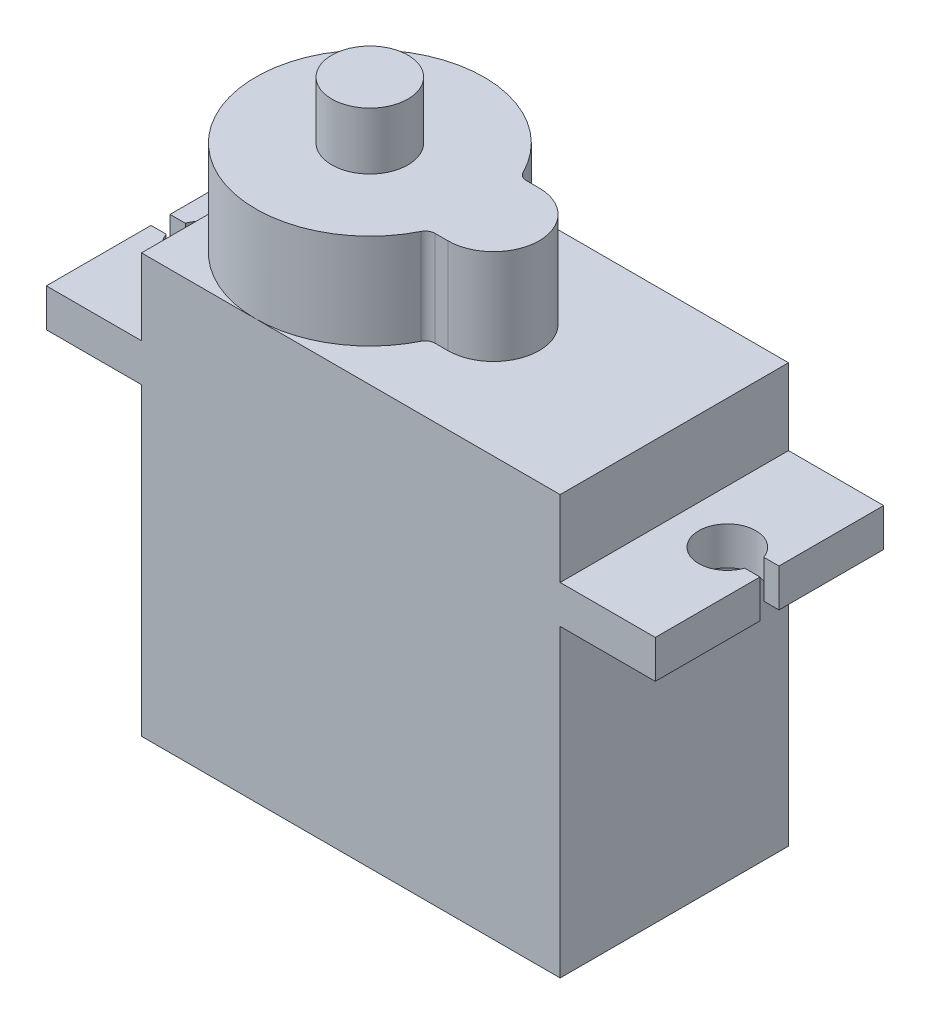
ISO-10303-21;
HEADER;
FILE_DESCRIPTION(('STEP AP214'),'2;1');
FILE_NAME('part.step','',(''),(''),'','','');
FILE_SCHEMA(('AUTOMOTIVE_DESIGN { 1 0 10303 214 1 1 1 1 }'));
ENDSEC;
DATA;
#1=APPLICATION_CONTEXT('core data for automotive mechanical design processes');
#2=APPLICATION_PROTOCOL_DEFINITION('international standard','automotive_design',2000,#1);
#3=PRODUCT_CONTEXT('',#1,'mechanical');
#4=PRODUCT('Part','Part','',(#3));
#5=PRODUCT_RELATED_PRODUCT_CATEGORY('part','',(#4));
#6=PRODUCT_DEFINITION_FORMATION('','',#4);
#7=PRODUCT_DEFINITION_CONTEXT('part definition',#1,'design');
#8=PRODUCT_DEFINITION('design','',#6,#7);
#9=PRODUCT_DEFINITION_SHAPE('','',#8);
#10=(LENGTH_UNIT() NAMED_UNIT(*) SI_UNIT(.MILLI.,.METRE.));
#11=(NAMED_UNIT(*) PLANE_ANGLE_UNIT() SI_UNIT($,.RADIAN.));
#12=(NAMED_UNIT(*) SI_UNIT($,.STERADIAN.) SOLID_ANGLE_UNIT());
#13=UNCERTAINTY_MEASURE_WITH_UNIT(LENGTH_MEASURE(1.E-05),#10,'distance_accuracy_value','');
#14=(GEOMETRIC_REPRESENTATION_CONTEXT(3) GLOBAL_UNCERTAINTY_ASSIGNED_CONTEXT((#13)) GLOBAL_UNIT_ASSIGNED_CONTEXT((#10,
#11,#12)) REPRESENTATION_CONTEXT('',''));
#15=CARTESIAN_POINT('',(0.,0.,0.));
#16=DIRECTION('',(0.,0.,1.));
#17=DIRECTION('',(1.,0.,0.));
#18=AXIS2_PLACEMENT_3D('',#15,#16,#17);
#19=CARTESIAN_POINT('',(-16.,7.,-12.));
#20=DIRECTION('',(-1.,0.,0.));
#21=DIRECTION('',(0.,0.,1.));
#22=AXIS2_PLACEMENT_3D('',#19,#20,#21);
#23=PLANE('',#22);
#24=DIRECTION('',(0.,0.,1.));
#25=VECTOR('',#24,1.);
#26=CARTESIAN_POINT('',(-16.,7.,-12.));
#27=LINE('',#26,#25);
#28=CARTESIAN_POINT('',(-16.,7.,-5.49999999997551));
#29=VERTEX_POINT('',#28);
#30=CARTESIAN_POINT('',(-16.,7.,0.));
#31=VERTEX_POINT('',#30);
#32=EDGE_CURVE('E455',#29,#31,#27,.T.);
#33=ORIENTED_EDGE('',*,*,#32,.F.);
#34=DIRECTION('',(0.,1.,0.));
#35=VECTOR('',#34,1.);
#36=CARTESIAN_POINT('',(-16.,-11.,-5.49999999997551));
#37=LINE('',#36,#35);
#38=CARTESIAN_POINT('',(-16.,4.99999999999999,-5.49999999997551));
#39=VERTEX_POINT('',#38);
#40=EDGE_CURVE('E255',#39,#29,#37,.T.);
#41=ORIENTED_EDGE('',*,*,#40,.F.);
#42=DIRECTION('',(0.,0.,1.));
#43=VECTOR('',#42,1.);
#44=CARTESIAN_POINT('',(-16.,5.,-12.));
#45=LINE('',#44,#43);
#46=CARTESIAN_POINT('',(-16.,5.,0.));
#47=VERTEX_POINT('',#46);
#48=EDGE_CURVE('E450',#39,#47,#45,.T.);
#49=ORIENTED_EDGE('',*,*,#48,.T.);
#50=DIRECTION('',(0.,-1.,0.));
#51=VECTOR('',#50,1.);
#52=CARTESIAN_POINT('',(-16.,7.,0.));
#53=LINE('',#52,#51);
#54=EDGE_CURVE('E391',#31,#47,#53,.T.);
#55=ORIENTED_EDGE('',*,*,#54,.F.);
#56=EDGE_LOOP('',(#33,#41,#49,#55));
#57=FACE_BOUND('',#56,.T.);
#58=ADVANCED_FACE('F46',(#57),#23,.T.);
#59=CARTESIAN_POINT('',(-16.,5.,-12.));
#60=VERTEX_POINT('',#59);
#61=CARTESIAN_POINT('',(-16.,4.99999999999999,-6.49999999997551));
#62=VERTEX_POINT('',#61);
#63=EDGE_CURVE('E447',#60,#62,#45,.T.);
#64=ORIENTED_EDGE('',*,*,#63,.T.);
#65=DIRECTION('',(0.,1.,0.));
#66=VECTOR('',#65,1.);
#67=CARTESIAN_POINT('',(-16.,-11.,-6.49999999997551));
#68=LINE('',#67,#66);
#69=CARTESIAN_POINT('',(-16.,7.,-6.49999999997551));
#70=VERTEX_POINT('',#69);
#71=EDGE_CURVE('E235',#62,#70,#68,.T.);
#72=ORIENTED_EDGE('',*,*,#71,.T.);
#73=CARTESIAN_POINT('',(-16.,7.,-12.));
#74=VERTEX_POINT('',#73);
#75=EDGE_CURVE('E451',#74,#70,#27,.T.);
#76=ORIENTED_EDGE('',*,*,#75,.F.);
#77=DIRECTION('',(0.,-1.,0.));
#78=VECTOR('',#77,1.);
#79=CARTESIAN_POINT('',(-16.,7.,-12.));
#80=LINE('',#79,#78);
#81=EDGE_CURVE('E342',#74,#60,#80,.T.);
#82=ORIENTED_EDGE('',*,*,#81,.T.);
#83=EDGE_LOOP('',(#64,#72,#76,#82));
#84=FACE_BOUND('',#83,.T.);
#85=ADVANCED_FACE('F535',(#84),#23,.T.);
#86=CARTESIAN_POINT('',(16.,7.,-12.));
#87=DIRECTION('',(1.,0.,0.));
#88=DIRECTION('',(0.,0.,-1.));
#89=AXIS2_PLACEMENT_3D('',#86,#87,#88);
#90=PLANE('',#89);
#91=DIRECTION('',(0.,1.,0.));
#92=VECTOR('',#91,1.);
#93=CARTESIAN_POINT('',(16.,-11.,-5.49999999997551));
#94=LINE('',#93,#92);
#95=CARTESIAN_POINT('',(16.,5.,-5.49999999997551));
#96=VERTEX_POINT('',#95);
#97=CARTESIAN_POINT('',(16.,7.,-5.49999999997551));
#98=VERTEX_POINT('',#97);
#99=EDGE_CURVE('E263',#96,#98,#94,.T.);
#100=ORIENTED_EDGE('',*,*,#99,.T.);
#101=DIRECTION('',(0.,0.,1.));
#102=VECTOR('',#101,1.);
#103=CARTESIAN_POINT('',(16.,7.,-12.));
#104=LINE('',#103,#102);
#105=CARTESIAN_POINT('',(16.,7.,0.));
#106=VERTEX_POINT('',#105);
#107=EDGE_CURVE('E429',#98,#106,#104,.T.);
#108=ORIENTED_EDGE('',*,*,#107,.T.);
#109=DIRECTION('',(0.,1.,0.));
#110=VECTOR('',#109,1.);
#111=CARTESIAN_POINT('',(16.,7.,0.));
#112=LINE('',#111,#110);
#113=CARTESIAN_POINT('',(16.,5.,0.));
#114=VERTEX_POINT('',#113);
#115=EDGE_CURVE('E415',#114,#106,#112,.T.);
#116=ORIENTED_EDGE('',*,*,#115,.F.);
#117=DIRECTION('',(0.,0.,1.));
#118=VECTOR('',#117,1.);
#119=CARTESIAN_POINT('',(16.,5.,-12.));
#120=LINE('',#119,#118);
#121=EDGE_CURVE('E434',#96,#114,#120,.T.);
#122=ORIENTED_EDGE('',*,*,#121,.F.);
#123=EDGE_LOOP('',(#100,#108,#116,#122));
#124=FACE_BOUND('',#123,.T.);
#125=ADVANCED_FACE('F541',(#124),#90,.T.);
#126=CARTESIAN_POINT('',(-11.,11.,-12.));
#127=DIRECTION('',(0.,1.,0.));
#128=DIRECTION('',(0.,0.,1.));
#129=AXIS2_PLACEMENT_3D('',#126,#127,#128);
#130=PLANE('',#129);
#131=CARTESIAN_POINT('',(-5.,11.,-6.));
#132=DIRECTION('',(0.,1.,0.));
#133=DIRECTION('',(0.,0.,1.));
#134=AXIS2_PLACEMENT_3D('',#131,#132,#133);
#135=CIRCLE('',#134,6.);
#136=CARTESIAN_POINT('',(-11.,11.,-6.));
#137=VERTEX_POINT('',#136);
#138=CARTESIAN_POINT('',(-5.,11.,0.));
#139=VERTEX_POINT('',#138);
#140=EDGE_CURVE('E312',#137,#139,#135,.T.);
#141=ORIENTED_EDGE('',*,*,#140,.F.);
#142=DIRECTION('',(0.,0.,1.));
#143=VECTOR('',#142,1.);
#144=CARTESIAN_POINT('',(-11.,11.,-12.));
#145=LINE('',#144,#143);
#146=CARTESIAN_POINT('',(-11.,11.,0.));
#147=VERTEX_POINT('',#146);
#148=EDGE_CURVE('E463',#137,#147,#145,.T.);
#149=ORIENTED_EDGE('',*,*,#148,.T.);
#150=DIRECTION('',(-1.,0.,0.));
#151=VECTOR('',#150,1.);
#152=CARTESIAN_POINT('',(-11.,11.,0.));
#153=LINE('',#152,#151);
#154=EDGE_CURVE('E378',#139,#147,#153,.T.);
#155=ORIENTED_EDGE('',*,*,#154,.F.);
#156=EDGE_LOOP('',(#141,#149,#155));
#157=FACE_BOUND('',#156,.T.);
#158=ADVANCED_FACE('F560',(#157),#130,.T.);
#159=CARTESIAN_POINT('',(0.369737688215013,11.,-8.67692307692308));
#160=VERTEX_POINT('',#159);
#161=CARTESIAN_POINT('',(-5.,11.,-12.));
#162=VERTEX_POINT('',#161);
#163=EDGE_CURVE('E309',#160,#162,#135,.T.);
#164=ORIENTED_EDGE('',*,*,#163,.F.);
#165=CARTESIAN_POINT('',(0.817215828899599,11.,-8.9));
#166=DIRECTION('',(0.,1.,0.));
#167=DIRECTION('',(0.,0.,1.));
#168=AXIS2_PLACEMENT_3D('',#165,#166,#167);
#169=CIRCLE('',#168,0.5);
#170=CARTESIAN_POINT('',(0.817215828899597,11.,-8.4));
#171=VERTEX_POINT('',#170);
#172=EDGE_CURVE('E495',#160,#171,#169,.T.);
#173=ORIENTED_EDGE('',*,*,#172,.T.);
#174=DIRECTION('',(-1.,0.,0.));
#175=VECTOR('',#174,1.);
#176=CARTESIAN_POINT('',(1.49909083394701,11.,-8.4));
#177=LINE('',#176,#175);
#178=CARTESIAN_POINT('',(1.49909083394701,11.,-8.4));
#179=VERTEX_POINT('',#178);
#180=EDGE_CURVE('E306',#179,#171,#177,.T.);
#181=ORIENTED_EDGE('',*,*,#180,.F.);
#182=CARTESIAN_POINT('',(1.49909083394701,11.,-6.));
#183=DIRECTION('',(0.,1.,0.));
#184=DIRECTION('',(0.,0.,1.));
#185=AXIS2_PLACEMENT_3D('',#182,#183,#184);
#186=CIRCLE('',#185,2.4);
#187=CARTESIAN_POINT('',(1.49909083394701,11.,-3.6));
#188=VERTEX_POINT('',#187);
#189=EDGE_CURVE('E287',#188,#179,#186,.T.);
#190=ORIENTED_EDGE('',*,*,#189,.F.);
#191=DIRECTION('',(1.,0.,0.));
#192=VECTOR('',#191,1.);
#193=CARTESIAN_POINT('',(1.49909083394701,11.,-3.6));
#194=LINE('',#193,#192);
#195=CARTESIAN_POINT('',(0.817215828899599,11.,-3.6));
#196=VERTEX_POINT('',#195);
#197=EDGE_CURVE('E293',#196,#188,#194,.T.);
#198=ORIENTED_EDGE('',*,*,#197,.F.);
#199=CARTESIAN_POINT('',(0.817215828899599,11.,-3.1));
#200=DIRECTION('',(0.,1.,0.));
#201=DIRECTION('',(0.,0.,1.));
#202=AXIS2_PLACEMENT_3D('',#199,#200,#201);
#203=CIRCLE('',#202,0.5);
#204=CARTESIAN_POINT('',(0.369737688215014,11.,-3.32307692307692));
#205=VERTEX_POINT('',#204);
#206=EDGE_CURVE('E492',#196,#205,#203,.T.);
#207=ORIENTED_EDGE('',*,*,#206,.T.);
#208=EDGE_CURVE('E589',#139,#205,#135,.T.);
#209=ORIENTED_EDGE('',*,*,#208,.F.);
#210=CARTESIAN_POINT('',(11.,11.,0.));
#211=VERTEX_POINT('',#210);
#212=EDGE_CURVE('E379',#211,#139,#153,.T.);
#213=ORIENTED_EDGE('',*,*,#212,.F.);
#214=DIRECTION('',(0.,0.,1.));
#215=VECTOR('',#214,1.);
#216=CARTESIAN_POINT('',(11.,11.,-12.));
#217=LINE('',#216,#215);
#218=CARTESIAN_POINT('',(11.,11.,-12.));
#219=VERTEX_POINT('',#218);
#220=EDGE_CURVE('E374',#219,#211,#217,.T.);
#221=ORIENTED_EDGE('',*,*,#220,.F.);
#222=DIRECTION('',(-1.,0.,0.));
#223=VECTOR('',#222,1.);
#224=CARTESIAN_POINT('',(-11.,11.,-12.));
#225=LINE('',#224,#223);
#226=EDGE_CURVE('E330',#219,#162,#225,.T.);
#227=ORIENTED_EDGE('',*,*,#226,.T.);
#228=EDGE_LOOP('',(#164,#173,#181,#190,#198,#207,#209,#213,#221,#227));
#229=FACE_BOUND('',#228,.T.);
#230=ADVANCED_FACE('F516',(#229),#130,.T.);
#231=CARTESIAN_POINT('',(11.,7.,-12.));
#232=DIRECTION('',(1.,0.,0.));
#233=DIRECTION('',(0.,0.,-1.));
#234=AXIS2_PLACEMENT_3D('',#231,#232,#233);
#235=PLANE('',#234);
#236=DIRECTION('',(0.,1.,0.));
#237=VECTOR('',#236,1.);
#238=CARTESIAN_POINT('',(11.,7.,0.));
#239=LINE('',#238,#237);
#240=CARTESIAN_POINT('',(11.,7.,0.));
#241=VERTEX_POINT('',#240);
#242=EDGE_CURVE('E323',#241,#211,#239,.T.);
#243=ORIENTED_EDGE('',*,*,#242,.F.);
#244=DIRECTION('',(0.,0.,1.));
#245=VECTOR('',#244,1.);
#246=CARTESIAN_POINT('',(11.,7.,-12.));
#247=LINE('',#246,#245);
#248=CARTESIAN_POINT('',(11.,7.,-12.));
#249=VERTEX_POINT('',#248);
#250=EDGE_CURVE('E422',#249,#241,#247,.T.);
#251=ORIENTED_EDGE('',*,*,#250,.F.);
#252=DIRECTION('',(0.,1.,0.));
#253=VECTOR('',#252,1.);
#254=CARTESIAN_POINT('',(11.,7.,-12.));
#255=LINE('',#254,#253);
#256=EDGE_CURVE('E324',#249,#219,#255,.T.);
#257=ORIENTED_EDGE('',*,*,#256,.T.);
#258=ORIENTED_EDGE('',*,*,#220,.T.);
#259=EDGE_LOOP('',(#243,#251,#257,#258));
#260=FACE_BOUND('',#259,.T.);
#261=ADVANCED_FACE('F561',(#260),#235,.T.);
#262=CARTESIAN_POINT('',(11.,7.,-12.));
#263=DIRECTION('',(0.,1.,0.));
#264=DIRECTION('',(0.,0.,1.));
#265=AXIS2_PLACEMENT_3D('',#262,#263,#264);
#266=PLANE('',#265);
#267=DIRECTION('',(1.,0.,0.));
#268=VECTOR('',#267,1.);
#269=CARTESIAN_POINT('',(11.,7.,-5.4999999999755));
#270=LINE('',#269,#268);
#271=CARTESIAN_POINT('',(15.2,7.,-5.49999999997551));
#272=VERTEX_POINT('',#271);
#273=EDGE_CURVE('E284',#272,#98,#270,.T.);
#274=ORIENTED_EDGE('',*,*,#273,.F.);
#275=CARTESIAN_POINT('',(13.7857864376269,7.,-5.99999999997551));
#276=DIRECTION('',(0.,1.,0.));
#277=DIRECTION('',(0.,0.,1.));
#278=AXIS2_PLACEMENT_3D('',#275,#276,#277);
#279=CIRCLE('',#278,1.5);
#280=CARTESIAN_POINT('',(15.2,7.,-6.49999999997551));
#281=VERTEX_POINT('',#280);
#282=EDGE_CURVE('E281',#281,#272,#279,.T.);
#283=ORIENTED_EDGE('',*,*,#282,.F.);
#284=DIRECTION('',(-1.,0.,0.));
#285=VECTOR('',#284,1.);
#286=CARTESIAN_POINT('',(11.,7.,-6.49999999997551));
#287=LINE('',#286,#285);
#288=CARTESIAN_POINT('',(16.,7.,-6.49999999997551));
#289=VERTEX_POINT('',#288);
#290=EDGE_CURVE('E268',#289,#281,#287,.T.);
#291=ORIENTED_EDGE('',*,*,#290,.F.);
#292=CARTESIAN_POINT('',(16.,7.,-12.));
#293=VERTEX_POINT('',#292);
#294=EDGE_CURVE('E425',#293,#289,#104,.T.);
#295=ORIENTED_EDGE('',*,*,#294,.F.);
#296=DIRECTION('',(-1.,0.,0.));
#297=VECTOR('',#296,1.);
#298=CARTESIAN_POINT('',(11.,7.,-12.));
#299=LINE('',#298,#297);
#300=EDGE_CURVE('E370',#293,#249,#299,.T.);
#301=ORIENTED_EDGE('',*,*,#300,.T.);
#302=ORIENTED_EDGE('',*,*,#250,.T.);
#303=DIRECTION('',(-1.,0.,0.));
#304=VECTOR('',#303,1.);
#305=CARTESIAN_POINT('',(11.,7.,0.));
#306=LINE('',#305,#304);
#307=EDGE_CURVE('E329',#106,#241,#306,.T.);
#308=ORIENTED_EDGE('',*,*,#307,.F.);
#309=ORIENTED_EDGE('',*,*,#107,.F.);
#310=EDGE_LOOP('',(#274,#283,#291,#295,#301,#302,#308,#309));
#311=FACE_BOUND('',#310,.T.);
#312=ADVANCED_FACE('F563',(#311),#266,.T.);
#313=DIRECTION('',(0.,1.,0.));
#314=VECTOR('',#313,1.);
#315=CARTESIAN_POINT('',(16.,-11.,-6.49999999997551));
#316=LINE('',#315,#314);
#317=CARTESIAN_POINT('',(16.,5.,-6.49999999997551));
#318=VERTEX_POINT('',#317);
#319=EDGE_CURVE('E273',#318,#289,#316,.T.);
#320=ORIENTED_EDGE('',*,*,#319,.F.);
#321=CARTESIAN_POINT('',(16.,5.,-12.));
#322=VERTEX_POINT('',#321);
#323=EDGE_CURVE('E430',#322,#318,#120,.T.);
#324=ORIENTED_EDGE('',*,*,#323,.F.);
#325=DIRECTION('',(0.,1.,0.));
#326=VECTOR('',#325,1.);
#327=CARTESIAN_POINT('',(16.,7.,-12.));
#328=LINE('',#327,#326);
#329=EDGE_CURVE('E366',#322,#293,#328,.T.);
#330=ORIENTED_EDGE('',*,*,#329,.T.);
#331=ORIENTED_EDGE('',*,*,#294,.T.);
#332=EDGE_LOOP('',(#320,#324,#330,#331));
#333=FACE_BOUND('',#332,.T.);
#334=ADVANCED_FACE('F569',(#333),#90,.T.);
#335=CARTESIAN_POINT('',(16.,5.,-12.));
#336=DIRECTION('',(0.,-1.,0.));
#337=DIRECTION('',(1.,0.,0.));
#338=AXIS2_PLACEMENT_3D('',#335,#336,#337);
#339=PLANE('',#338);
#340=DIRECTION('',(-1.,0.,0.));
#341=VECTOR('',#340,1.);
#342=CARTESIAN_POINT('',(16.,5.,-5.49999999997551));
#343=LINE('',#342,#341);
#344=CARTESIAN_POINT('',(15.2,5.,-5.49999999997551));
#345=VERTEX_POINT('',#344);
#346=EDGE_CURVE('E473',#96,#345,#343,.T.);
#347=ORIENTED_EDGE('',*,*,#346,.F.);
#348=ORIENTED_EDGE('',*,*,#121,.T.);
#349=DIRECTION('',(1.,0.,0.));
#350=VECTOR('',#349,1.);
#351=CARTESIAN_POINT('',(16.,5.,0.));
#352=LINE('',#351,#350);
#353=CARTESIAN_POINT('',(11.,5.,0.));
#354=VERTEX_POINT('',#353);
#355=EDGE_CURVE('E411',#354,#114,#352,.T.);
#356=ORIENTED_EDGE('',*,*,#355,.F.);
#357=DIRECTION('',(0.,0.,1.));
#358=VECTOR('',#357,1.);
#359=CARTESIAN_POINT('',(11.,5.,-12.));
#360=LINE('',#359,#358);
#361=CARTESIAN_POINT('',(11.,5.,-12.));
#362=VERTEX_POINT('',#361);
#363=EDGE_CURVE('E435',#362,#354,#360,.T.);
#364=ORIENTED_EDGE('',*,*,#363,.F.);
#365=DIRECTION('',(1.,0.,0.));
#366=VECTOR('',#365,1.);
#367=CARTESIAN_POINT('',(16.,5.,-12.));
#368=LINE('',#367,#366);
#369=EDGE_CURVE('E362',#362,#322,#368,.T.);
#370=ORIENTED_EDGE('',*,*,#369,.T.);
#371=ORIENTED_EDGE('',*,*,#323,.T.);
#372=DIRECTION('',(1.,0.,0.));
#373=VECTOR('',#372,1.);
#374=CARTESIAN_POINT('',(16.,5.,-6.49999999997551));
#375=LINE('',#374,#373);
#376=CARTESIAN_POINT('',(15.2,5.,-6.49999999997551));
#377=VERTEX_POINT('',#376);
#378=EDGE_CURVE('E466',#377,#318,#375,.T.);
#379=ORIENTED_EDGE('',*,*,#378,.F.);
#380=CARTESIAN_POINT('',(13.7857864376269,5.,-5.99999999997551));
#381=DIRECTION('',(0.,-1.,0.));
#382=DIRECTION('',(1.,0.,0.));
#383=AXIS2_PLACEMENT_3D('',#380,#381,#382);
#384=CIRCLE('',#383,1.5);
#385=EDGE_CURVE('E469',#345,#377,#384,.T.);
#386=ORIENTED_EDGE('',*,*,#385,.F.);
#387=EDGE_LOOP('',(#347,#348,#356,#364,#370,#371,#379,#386));
#388=FACE_BOUND('',#387,.T.);
#389=ADVANCED_FACE('F631',(#388),#339,.T.);
#390=CARTESIAN_POINT('',(11.,-11.,-12.));
#391=DIRECTION('',(1.,0.,0.));
#392=DIRECTION('',(0.,0.,-1.));
#393=AXIS2_PLACEMENT_3D('',#390,#391,#392);
#394=PLANE('',#393);
#395=DIRECTION('',(0.,1.,0.));
#396=VECTOR('',#395,1.);
#397=CARTESIAN_POINT('',(11.,-11.,0.));
#398=LINE('',#397,#396);
#399=CARTESIAN_POINT('',(11.,-11.,0.));
#400=VERTEX_POINT('',#399);
#401=EDGE_CURVE('E407',#400,#354,#398,.T.);
#402=ORIENTED_EDGE('',*,*,#401,.F.);
#403=DIRECTION('',(0.,0.,1.));
#404=VECTOR('',#403,1.);
#405=CARTESIAN_POINT('',(11.,-11.,-12.));
#406=LINE('',#405,#404);
#407=CARTESIAN_POINT('',(11.,-11.,-12.));
#408=VERTEX_POINT('',#407);
#409=EDGE_CURVE('E438',#408,#400,#406,.T.);
#410=ORIENTED_EDGE('',*,*,#409,.F.);
#411=DIRECTION('',(0.,1.,0.));
#412=VECTOR('',#411,1.);
#413=CARTESIAN_POINT('',(11.,-11.,-12.));
#414=LINE('',#413,#412);
#415=EDGE_CURVE('E358',#408,#362,#414,.T.);
#416=ORIENTED_EDGE('',*,*,#415,.T.);
#417=ORIENTED_EDGE('',*,*,#363,.T.);
#418=EDGE_LOOP('',(#402,#410,#416,#417));
#419=FACE_BOUND('',#418,.T.);
#420=ADVANCED_FACE('F627',(#419),#394,.T.);
#421=CARTESIAN_POINT('',(-11.,-11.,-12.));
#422=DIRECTION('',(0.,-1.,0.));
#423=DIRECTION('',(0.,0.,-1.));
#424=AXIS2_PLACEMENT_3D('',#421,#422,#423);
#425=PLANE('',#424);
#426=DIRECTION('',(1.,0.,0.));
#427=VECTOR('',#426,1.);
#428=CARTESIAN_POINT('',(-11.,-11.,0.));
#429=LINE('',#428,#427);
#430=CARTESIAN_POINT('',(-11.,-11.,0.));
#431=VERTEX_POINT('',#430);
#432=EDGE_CURVE('E403',#431,#400,#429,.T.);
#433=ORIENTED_EDGE('',*,*,#432,.F.);
#434=DIRECTION('',(0.,0.,1.));
#435=VECTOR('',#434,1.);
#436=CARTESIAN_POINT('',(-11.,-11.,-12.));
#437=LINE('',#436,#435);
#438=CARTESIAN_POINT('',(-11.,-11.,-12.));
#439=VERTEX_POINT('',#438);
#440=EDGE_CURVE('E441',#439,#431,#437,.T.);
#441=ORIENTED_EDGE('',*,*,#440,.F.);
#442=DIRECTION('',(1.,0.,0.));
#443=VECTOR('',#442,1.);
#444=CARTESIAN_POINT('',(-11.,-11.,-12.));
#445=LINE('',#444,#443);
#446=EDGE_CURVE('E354',#439,#408,#445,.T.);
#447=ORIENTED_EDGE('',*,*,#446,.T.);
#448=ORIENTED_EDGE('',*,*,#409,.T.);
#449=EDGE_LOOP('',(#433,#441,#447,#448));
#450=FACE_BOUND('',#449,.T.);
#451=ADVANCED_FACE('F623',(#450),#425,.T.);
#452=CARTESIAN_POINT('',(-11.,-11.,-12.));
#453=DIRECTION('',(-1.,0.,0.));
#454=DIRECTION('',(0.,0.,1.));
#455=AXIS2_PLACEMENT_3D('',#452,#453,#454);
#456=PLANE('',#455);
#457=DIRECTION('',(0.,-1.,0.));
#458=VECTOR('',#457,1.);
#459=CARTESIAN_POINT('',(-11.,-11.,0.));
#460=LINE('',#459,#458);
#461=CARTESIAN_POINT('',(-11.,5.,0.));
#462=VERTEX_POINT('',#461);
#463=EDGE_CURVE('E399',#462,#431,#460,.T.);
#464=ORIENTED_EDGE('',*,*,#463,.F.);
#465=DIRECTION('',(0.,0.,1.));
#466=VECTOR('',#465,1.);
#467=CARTESIAN_POINT('',(-11.,5.,-12.));
#468=LINE('',#467,#466);
#469=CARTESIAN_POINT('',(-11.,5.,-12.));
#470=VERTEX_POINT('',#469);
#471=EDGE_CURVE('E444',#470,#462,#468,.T.);
#472=ORIENTED_EDGE('',*,*,#471,.F.);
#473=DIRECTION('',(0.,-1.,0.));
#474=VECTOR('',#473,1.);
#475=CARTESIAN_POINT('',(-11.,-11.,-12.));
#476=LINE('',#475,#474);
#477=EDGE_CURVE('E350',#470,#439,#476,.T.);
#478=ORIENTED_EDGE('',*,*,#477,.T.);
#479=ORIENTED_EDGE('',*,*,#440,.T.);
#480=EDGE_LOOP('',(#464,#472,#478,#479));
#481=FACE_BOUND('',#480,.T.);
#482=ADVANCED_FACE('F619',(#481),#456,.T.);
#483=CARTESIAN_POINT('',(-16.,5.,-12.));
#484=DIRECTION('',(0.,-1.,0.));
#485=DIRECTION('',(0.,0.,-1.));
#486=AXIS2_PLACEMENT_3D('',#483,#484,#485);
#487=PLANE('',#486);
#488=ORIENTED_EDGE('',*,*,#48,.F.);
#489=DIRECTION('',(1.,0.,0.));
#490=VECTOR('',#489,1.);
#491=CARTESIAN_POINT('',(-16.,5.,-5.49999999997551));
#492=LINE('',#491,#490);
#493=CARTESIAN_POINT('',(-15.2,4.99999999999999,-5.49999999997551));
#494=VERTEX_POINT('',#493);
#495=EDGE_CURVE('E240',#39,#494,#492,.T.);
#496=ORIENTED_EDGE('',*,*,#495,.T.);
#497=CARTESIAN_POINT('',(-13.7857864376269,4.99999999999999,-5.99999999997551));
#498=DIRECTION('',(0.,-1.,0.));
#499=DIRECTION('',(0.,0.,-1.));
#500=AXIS2_PLACEMENT_3D('',#497,#498,#499);
#501=CIRCLE('',#500,1.5);
#502=CARTESIAN_POINT('',(-15.2,4.99999999999999,-6.49999999997551));
#503=VERTEX_POINT('',#502);
#504=EDGE_CURVE('E241',#494,#503,#501,.F.);
#505=ORIENTED_EDGE('',*,*,#504,.T.);
#506=DIRECTION('',(-1.,0.,0.));
#507=VECTOR('',#506,1.);
#508=CARTESIAN_POINT('',(-16.,5.,-6.49999999997551));
#509=LINE('',#508,#507);
#510=EDGE_CURVE('E229',#503,#62,#509,.T.);
#511=ORIENTED_EDGE('',*,*,#510,.T.);
#512=ORIENTED_EDGE('',*,*,#63,.F.);
#513=DIRECTION('',(1.,0.,0.));
#514=VECTOR('',#513,1.);
#515=CARTESIAN_POINT('',(-16.,5.,-12.));
#516=LINE('',#515,#514);
#517=EDGE_CURVE('E346',#60,#470,#516,.T.);
#518=ORIENTED_EDGE('',*,*,#517,.T.);
#519=ORIENTED_EDGE('',*,*,#471,.T.);
#520=DIRECTION('',(1.,0.,0.));
#521=VECTOR('',#520,1.);
#522=CARTESIAN_POINT('',(-16.,5.,0.));
#523=LINE('',#522,#521);
#524=EDGE_CURVE('E395',#47,#462,#523,.T.);
#525=ORIENTED_EDGE('',*,*,#524,.F.);
#526=EDGE_LOOP('',(#488,#496,#505,#511,#512,#518,#519,#525));
#527=FACE_BOUND('',#526,.T.);
#528=ADVANCED_FACE('F253',(#527),#487,.T.);
#529=CARTESIAN_POINT('',(-11.,7.,-12.));
#530=DIRECTION('',(0.,1.,0.));
#531=DIRECTION('',(-1.,0.,0.));
#532=AXIS2_PLACEMENT_3D('',#529,#530,#531);
#533=PLANE('',#532);
#534=CARTESIAN_POINT('',(-13.7857864376269,7.,-5.99999999997551));
#535=DIRECTION('',(0.,1.,0.));
#536=DIRECTION('',(-1.,0.,0.));
#537=AXIS2_PLACEMENT_3D('',#534,#535,#536);
#538=CIRCLE('',#537,1.5);
#539=CARTESIAN_POINT('',(-15.2,7.,-6.49999999997551));
#540=VERTEX_POINT('',#539);
#541=CARTESIAN_POINT('',(-15.2,7.,-5.49999999997551));
#542=VERTEX_POINT('',#541);
#543=EDGE_CURVE('E247',#540,#542,#538,.F.);
#544=ORIENTED_EDGE('',*,*,#543,.T.);
#545=DIRECTION('',(-1.,0.,0.));
#546=VECTOR('',#545,1.);
#547=CARTESIAN_POINT('',(-11.,7.,-5.4999999999755));
#548=LINE('',#547,#546);
#549=EDGE_CURVE('E481',#542,#29,#548,.T.);
#550=ORIENTED_EDGE('',*,*,#549,.T.);
#551=ORIENTED_EDGE('',*,*,#32,.T.);
#552=DIRECTION('',(-1.,0.,0.));
#553=VECTOR('',#552,1.);
#554=CARTESIAN_POINT('',(-11.,7.,0.));
#555=LINE('',#554,#553);
#556=CARTESIAN_POINT('',(-11.,7.,0.));
#557=VERTEX_POINT('',#556);
#558=EDGE_CURVE('E387',#557,#31,#555,.T.);
#559=ORIENTED_EDGE('',*,*,#558,.F.);
#560=DIRECTION('',(0.,0.,1.));
#561=VECTOR('',#560,1.);
#562=CARTESIAN_POINT('',(-11.,7.,-12.));
#563=LINE('',#562,#561);
#564=CARTESIAN_POINT('',(-11.,7.,-12.));
#565=VERTEX_POINT('',#564);
#566=EDGE_CURVE('E456',#565,#557,#563,.T.);
#567=ORIENTED_EDGE('',*,*,#566,.F.);
#568=DIRECTION('',(-1.,0.,0.));
#569=VECTOR('',#568,1.);
#570=CARTESIAN_POINT('',(-11.,7.,-12.));
#571=LINE('',#570,#569);
#572=EDGE_CURVE('E338',#565,#74,#571,.T.);
#573=ORIENTED_EDGE('',*,*,#572,.T.);
#574=ORIENTED_EDGE('',*,*,#75,.T.);
#575=DIRECTION('',(1.,0.,0.));
#576=VECTOR('',#575,1.);
#577=CARTESIAN_POINT('',(-11.,7.,-6.49999999997551));
#578=LINE('',#577,#576);
#579=EDGE_CURVE('E478',#70,#540,#578,.T.);
#580=ORIENTED_EDGE('',*,*,#579,.T.);
#581=EDGE_LOOP('',(#544,#550,#551,#559,#567,#573,#574,#580));
#582=FACE_BOUND('',#581,.T.);
#583=ADVANCED_FACE('F547',(#582),#533,.T.);
#584=CARTESIAN_POINT('',(-11.,7.,-12.));
#585=DIRECTION('',(-1.,0.,0.));
#586=DIRECTION('',(0.,0.,1.));
#587=AXIS2_PLACEMENT_3D('',#584,#585,#586);
#588=PLANE('',#587);
#589=DIRECTION('',(0.,-1.,0.));
#590=VECTOR('',#589,1.);
#591=CARTESIAN_POINT('',(-11.,7.,0.));
#592=LINE('',#591,#590);
#593=EDGE_CURVE('E383',#147,#557,#592,.T.);
#594=ORIENTED_EDGE('',*,*,#593,.F.);
#595=ORIENTED_EDGE('',*,*,#148,.F.);
#596=CARTESIAN_POINT('',(-11.,11.,-12.));
#597=VERTEX_POINT('',#596);
#598=EDGE_CURVE('E459',#597,#137,#145,.T.);
#599=ORIENTED_EDGE('',*,*,#598,.F.);
#600=DIRECTION('',(0.,-1.,0.));
#601=VECTOR('',#600,1.);
#602=CARTESIAN_POINT('',(-11.,7.,-12.));
#603=LINE('',#602,#601);
#604=EDGE_CURVE('E334',#597,#565,#603,.T.);
#605=ORIENTED_EDGE('',*,*,#604,.T.);
#606=ORIENTED_EDGE('',*,*,#566,.T.);
#607=EDGE_LOOP('',(#594,#595,#599,#605,#606));
#608=FACE_BOUND('',#607,.T.);
#609=ADVANCED_FACE('F550',(#608),#588,.T.);
#610=EDGE_CURVE('E313',#162,#137,#135,.T.);
#611=ORIENTED_EDGE('',*,*,#610,.F.);
#612=EDGE_CURVE('E328',#162,#597,#225,.T.);
#613=ORIENTED_EDGE('',*,*,#612,.T.);
#614=ORIENTED_EDGE('',*,*,#598,.T.);
#615=EDGE_LOOP('',(#611,#613,#614));
#616=FACE_BOUND('',#615,.T.);
#617=ADVANCED_FACE('F554',(#616),#130,.T.);
#618=CARTESIAN_POINT('',(0.,0.,-12.));
#619=DIRECTION('',(0.,0.,-1.));
#620=DIRECTION('',(-1.,0.,0.));
#621=AXIS2_PLACEMENT_3D('',#618,#619,#620);
#622=PLANE('',#621);
#623=ORIENTED_EDGE('',*,*,#256,.F.);
#624=ORIENTED_EDGE('',*,*,#300,.F.);
#625=ORIENTED_EDGE('',*,*,#329,.F.);
#626=ORIENTED_EDGE('',*,*,#369,.F.);
#627=ORIENTED_EDGE('',*,*,#415,.F.);
#628=ORIENTED_EDGE('',*,*,#446,.F.);
#629=ORIENTED_EDGE('',*,*,#477,.F.);
#630=ORIENTED_EDGE('',*,*,#517,.F.);
#631=ORIENTED_EDGE('',*,*,#81,.F.);
#632=ORIENTED_EDGE('',*,*,#572,.F.);
#633=ORIENTED_EDGE('',*,*,#604,.F.);
#634=ORIENTED_EDGE('',*,*,#612,.F.);
#635=ORIENTED_EDGE('',*,*,#226,.F.);
#636=EDGE_LOOP('',(#623,#624,#625,#626,#627,#628,#629,#630,#631,#632,#633,#634,#635));
#637=FACE_BOUND('',#636,.T.);
#638=ADVANCED_FACE('F558',(#637),#622,.T.);
#639=CARTESIAN_POINT('',(0.,0.,0.));
#640=DIRECTION('',(0.,0.,-1.));
#641=DIRECTION('',(-1.,0.,0.));
#642=AXIS2_PLACEMENT_3D('',#639,#640,#641);
#643=PLANE('',#642);
#644=ORIENTED_EDGE('',*,*,#242,.T.);
#645=ORIENTED_EDGE('',*,*,#212,.T.);
#646=ORIENTED_EDGE('',*,*,#154,.T.);
#647=ORIENTED_EDGE('',*,*,#593,.T.);
#648=ORIENTED_EDGE('',*,*,#558,.T.);
#649=ORIENTED_EDGE('',*,*,#54,.T.);
#650=ORIENTED_EDGE('',*,*,#524,.T.);
#651=ORIENTED_EDGE('',*,*,#463,.T.);
#652=ORIENTED_EDGE('',*,*,#432,.T.);
#653=ORIENTED_EDGE('',*,*,#401,.T.);
#654=ORIENTED_EDGE('',*,*,#355,.T.);
#655=ORIENTED_EDGE('',*,*,#115,.T.);
#656=ORIENTED_EDGE('',*,*,#307,.T.);
#657=EDGE_LOOP('',(#644,#645,#646,#647,#648,#649,#650,#651,#652,#653,#654,#655,#656));
#658=FACE_BOUND('',#657,.T.);
#659=ADVANCED_FACE('F577',(#658),#643,.F.);
#660=CARTESIAN_POINT('',(1.49909083394701,16.,-6.));
#661=DIRECTION('',(0.,-1.,0.));
#662=DIRECTION('',(0.,0.,-1.));
#663=AXIS2_PLACEMENT_3D('',#660,#661,#662);
#664=CYLINDRICAL_SURFACE('',#663,2.4);
#665=ORIENTED_EDGE('',*,*,#189,.T.);
#666=DIRECTION('',(0.,-1.,0.));
#667=VECTOR('',#666,1.);
#668=CARTESIAN_POINT('',(1.49909083394701,16.,-8.4));
#669=LINE('',#668,#667);
#670=CARTESIAN_POINT('',(1.49909083394701,16.,-8.4));
#671=VERTEX_POINT('',#670);
#672=EDGE_CURVE('E319',#671,#179,#669,.T.);
#673=ORIENTED_EDGE('',*,*,#672,.F.);
#674=CARTESIAN_POINT('',(1.49909083394701,16.,-6.));
#675=DIRECTION('',(0.,1.,0.));
#676=DIRECTION('',(0.,0.,1.));
#677=AXIS2_PLACEMENT_3D('',#674,#675,#676);
#678=CIRCLE('',#677,2.4);
#679=CARTESIAN_POINT('',(1.49909083394701,16.,-3.6));
#680=VERTEX_POINT('',#679);
#681=EDGE_CURVE('E288',#680,#671,#678,.T.);
#682=ORIENTED_EDGE('',*,*,#681,.F.);
#683=DIRECTION('',(0.,-1.,0.));
#684=VECTOR('',#683,1.);
#685=CARTESIAN_POINT('',(1.49909083394701,16.,-3.6));
#686=LINE('',#685,#684);
#687=EDGE_CURVE('E302',#680,#188,#686,.T.);
#688=ORIENTED_EDGE('',*,*,#687,.T.);
#689=EDGE_LOOP('',(#665,#673,#682,#688));
#690=FACE_BOUND('',#689,.T.);
#691=ADVANCED_FACE('F522',(#690),#664,.T.);
#692=CARTESIAN_POINT('',(1.49909083394701,16.,-8.4));
#693=DIRECTION('',(0.,0.,1.));
#694=DIRECTION('',(1.,0.,0.));
#695=AXIS2_PLACEMENT_3D('',#692,#693,#694);
#696=PLANE('',#695);
#697=ORIENTED_EDGE('',*,*,#180,.T.);
#698=DIRECTION('',(0.,1.,0.));
#699=VECTOR('',#698,1.);
#700=CARTESIAN_POINT('',(0.817215828899597,16.,-8.4));
#701=LINE('',#700,#699);
#702=CARTESIAN_POINT('',(0.817215828899597,16.,-8.4));
#703=VERTEX_POINT('',#702);
#704=EDGE_CURVE('E68',#171,#703,#701,.T.);
#705=ORIENTED_EDGE('',*,*,#704,.T.);
#706=DIRECTION('',(-1.,0.,0.));
#707=VECTOR('',#706,1.);
#708=CARTESIAN_POINT('',(1.49909083394701,16.,-8.4));
#709=LINE('',#708,#707);
#710=EDGE_CURVE('E292',#671,#703,#709,.T.);
#711=ORIENTED_EDGE('',*,*,#710,.F.);
#712=ORIENTED_EDGE('',*,*,#672,.T.);
#713=EDGE_LOOP('',(#697,#705,#711,#712));
#714=FACE_BOUND('',#713,.T.);
#715=ADVANCED_FACE('F518',(#714),#696,.F.);
#716=CARTESIAN_POINT('',(-5.,16.,-6.));
#717=DIRECTION('',(0.,-1.,0.));
#718=DIRECTION('',(0.,0.,-1.));
#719=AXIS2_PLACEMENT_3D('',#716,#717,#718);
#720=CYLINDRICAL_SURFACE('',#719,6.);
#721=CARTESIAN_POINT('',(-5.,16.,-6.));
#722=DIRECTION('',(0.,1.,0.));
#723=DIRECTION('',(0.,0.,1.));
#724=AXIS2_PLACEMENT_3D('',#721,#722,#723);
#725=CIRCLE('',#724,6.);
#726=CARTESIAN_POINT('',(0.369737688215013,16.,-8.67692307692308));
#727=VERTEX_POINT('',#726);
#728=CARTESIAN_POINT('',(0.369737688215014,16.,-3.32307692307692));
#729=VERTEX_POINT('',#728);
#730=EDGE_CURVE('E296',#727,#729,#725,.T.);
#731=ORIENTED_EDGE('',*,*,#730,.F.);
#732=DIRECTION('',(0.,-1.,0.));
#733=VECTOR('',#732,1.);
#734=CARTESIAN_POINT('',(0.369737688215014,16.,-8.67692307692308));
#735=LINE('',#734,#733);
#736=EDGE_CURVE('E488',#727,#160,#735,.T.);
#737=ORIENTED_EDGE('',*,*,#736,.T.);
#738=ORIENTED_EDGE('',*,*,#163,.T.);
#739=ORIENTED_EDGE('',*,*,#610,.T.);
#740=ORIENTED_EDGE('',*,*,#140,.T.);
#741=ORIENTED_EDGE('',*,*,#208,.T.);
#742=DIRECTION('',(0.,-1.,0.));
#743=VECTOR('',#742,1.);
#744=CARTESIAN_POINT('',(0.369737688215014,16.,-3.32307692307692));
#745=LINE('',#744,#743);
#746=EDGE_CURVE('E485',#205,#729,#745,.F.);
#747=ORIENTED_EDGE('',*,*,#746,.T.);
#748=EDGE_LOOP('',(#731,#737,#738,#739,#740,#741,#747));
#749=FACE_BOUND('',#748,.T.);
#750=ADVANCED_FACE('F510',(#749),#720,.T.);
#751=CARTESIAN_POINT('',(1.49909083394701,16.,-3.6));
#752=DIRECTION('',(0.,0.,-1.));
#753=DIRECTION('',(-1.,0.,0.));
#754=AXIS2_PLACEMENT_3D('',#751,#752,#753);
#755=PLANE('',#754);
#756=DIRECTION('',(1.,0.,0.));
#757=VECTOR('',#756,1.);
#758=CARTESIAN_POINT('',(1.49909083394701,16.,-3.6));
#759=LINE('',#758,#757);
#760=CARTESIAN_POINT('',(0.817215828899599,16.,-3.6));
#761=VERTEX_POINT('',#760);
#762=EDGE_CURVE('E299',#761,#680,#759,.T.);
#763=ORIENTED_EDGE('',*,*,#762,.F.);
#764=DIRECTION('',(0.,1.,0.));
#765=VECTOR('',#764,1.);
#766=CARTESIAN_POINT('',(0.817215828899599,11.,-3.6));
#767=LINE('',#766,#765);
#768=EDGE_CURVE('E500',#761,#196,#767,.F.);
#769=ORIENTED_EDGE('',*,*,#768,.T.);
#770=ORIENTED_EDGE('',*,*,#197,.T.);
#771=ORIENTED_EDGE('',*,*,#687,.F.);
#772=EDGE_LOOP('',(#763,#769,#770,#771));
#773=FACE_BOUND('',#772,.T.);
#774=ADVANCED_FACE('F526',(#773),#755,.F.);
#775=CARTESIAN_POINT('',(1.49909083394701,16.,-6.));
#776=DIRECTION('',(0.,1.,0.));
#777=DIRECTION('',(0.,0.,1.));
#778=AXIS2_PLACEMENT_3D('',#775,#776,#777);
#779=PLANE('',#778);
#780=CARTESIAN_POINT('',(-5.,16.,-6.));
#781=DIRECTION('',(0.,1.,0.));
#782=DIRECTION('',(0.,0.,1.));
#783=AXIS2_PLACEMENT_3D('',#780,#781,#782);
#784=CIRCLE('',#783,2.);
#785=CARTESIAN_POINT('',(-5.,16.,-4.));
#786=VERTEX_POINT('',#785);
#787=EDGE_CURVE('E649',#786,#786,#784,.T.);
#788=ORIENTED_EDGE('',*,*,#787,.F.);
#789=EDGE_LOOP('',(#788));
#790=FACE_BOUND('',#789,.T.);
#791=ORIENTED_EDGE('',*,*,#681,.T.);
#792=ORIENTED_EDGE('',*,*,#710,.T.);
#793=CARTESIAN_POINT('',(0.817215828899599,16.,-8.9));
#794=DIRECTION('',(0.,1.,0.));
#795=DIRECTION('',(0.,0.,1.));
#796=AXIS2_PLACEMENT_3D('',#793,#794,#795);
#797=CIRCLE('',#796,0.5);
#798=EDGE_CURVE('E55',#703,#727,#797,.F.);
#799=ORIENTED_EDGE('',*,*,#798,.T.);
#800=ORIENTED_EDGE('',*,*,#730,.T.);
#801=CARTESIAN_POINT('',(0.817215828899599,16.,-3.1));
#802=DIRECTION('',(0.,1.,0.));
#803=DIRECTION('',(0.,0.,1.));
#804=AXIS2_PLACEMENT_3D('',#801,#802,#803);
#805=CIRCLE('',#804,0.5);
#806=EDGE_CURVE('E11',#729,#761,#805,.F.);
#807=ORIENTED_EDGE('',*,*,#806,.T.);
#808=ORIENTED_EDGE('',*,*,#762,.T.);
#809=EDGE_LOOP('',(#791,#792,#799,#800,#807,#808));
#810=FACE_BOUND('',#809,.T.);
#811=ADVANCED_FACE('F506',(#790,#810),#779,.T.);
#812=CARTESIAN_POINT('',(16.,-11.,-5.49999999997551));
#813=DIRECTION('',(0.,0.,1.));
#814=DIRECTION('',(1.,0.,0.));
#815=AXIS2_PLACEMENT_3D('',#812,#813,#814);
#816=PLANE('',#815);
#817=ORIENTED_EDGE('',*,*,#273,.T.);
#818=ORIENTED_EDGE('',*,*,#99,.F.);
#819=ORIENTED_EDGE('',*,*,#346,.T.);
#820=DIRECTION('',(0.,1.,0.));
#821=VECTOR('',#820,1.);
#822=CARTESIAN_POINT('',(15.2,-11.,-5.49999999997551));
#823=LINE('',#822,#821);
#824=EDGE_CURVE('E264',#345,#272,#823,.T.);
#825=ORIENTED_EDGE('',*,*,#824,.T.);
#826=EDGE_LOOP('',(#817,#818,#819,#825));
#827=FACE_BOUND('',#826,.T.);
#828=ADVANCED_FACE('F636',(#827),#816,.F.);
#829=CARTESIAN_POINT('',(13.7857864376269,-11.,-5.99999999997551));
#830=DIRECTION('',(0.,1.,0.));
#831=DIRECTION('',(0.,0.,1.));
#832=AXIS2_PLACEMENT_3D('',#829,#830,#831);
#833=CYLINDRICAL_SURFACE('',#832,1.5);
#834=ORIENTED_EDGE('',*,*,#282,.T.);
#835=ORIENTED_EDGE('',*,*,#824,.F.);
#836=ORIENTED_EDGE('',*,*,#385,.T.);
#837=DIRECTION('',(0.,1.,0.));
#838=VECTOR('',#837,1.);
#839=CARTESIAN_POINT('',(15.2,-11.,-6.49999999997551));
#840=LINE('',#839,#838);
#841=EDGE_CURVE('E269',#377,#281,#840,.T.);
#842=ORIENTED_EDGE('',*,*,#841,.T.);
#843=EDGE_LOOP('',(#834,#835,#836,#842));
#844=FACE_BOUND('',#843,.T.);
#845=ADVANCED_FACE('F640',(#844),#833,.F.);
#846=CARTESIAN_POINT('',(15.2,-11.,-6.49999999997551));
#847=DIRECTION('',(0.,0.,-1.));
#848=DIRECTION('',(-1.,0.,0.));
#849=AXIS2_PLACEMENT_3D('',#846,#847,#848);
#850=PLANE('',#849);
#851=ORIENTED_EDGE('',*,*,#290,.T.);
#852=ORIENTED_EDGE('',*,*,#841,.F.);
#853=ORIENTED_EDGE('',*,*,#378,.T.);
#854=ORIENTED_EDGE('',*,*,#319,.T.);
#855=EDGE_LOOP('',(#851,#852,#853,#854));
#856=FACE_BOUND('',#855,.T.);
#857=ADVANCED_FACE('F643',(#856),#850,.F.);
#858=CARTESIAN_POINT('',(-16.,-11.,-5.49999999997551));
#859=DIRECTION('',(0.,0.,-1.));
#860=DIRECTION('',(-1.,0.,0.));
#861=AXIS2_PLACEMENT_3D('',#858,#859,#860);
#862=PLANE('',#861);
#863=ORIENTED_EDGE('',*,*,#40,.T.);
#864=ORIENTED_EDGE('',*,*,#549,.F.);
#865=DIRECTION('',(0.,1.,0.));
#866=VECTOR('',#865,1.);
#867=CARTESIAN_POINT('',(-15.2,-11.,-5.49999999997551));
#868=LINE('',#867,#866);
#869=EDGE_CURVE('E249',#494,#542,#868,.T.);
#870=ORIENTED_EDGE('',*,*,#869,.F.);
#871=ORIENTED_EDGE('',*,*,#495,.F.);
#872=EDGE_LOOP('',(#863,#864,#870,#871));
#873=FACE_BOUND('',#872,.T.);
#874=ADVANCED_FACE('F661',(#873),#862,.T.);
#875=CARTESIAN_POINT('',(-15.2,-11.,-6.49999999997551));
#876=DIRECTION('',(0.,0.,1.));
#877=DIRECTION('',(1.,0.,0.));
#878=AXIS2_PLACEMENT_3D('',#875,#876,#877);
#879=PLANE('',#878);
#880=DIRECTION('',(0.,1.,0.));
#881=VECTOR('',#880,1.);
#882=CARTESIAN_POINT('',(-15.2,-11.,-6.49999999997551));
#883=LINE('',#882,#881);
#884=EDGE_CURVE('E232',#503,#540,#883,.T.);
#885=ORIENTED_EDGE('',*,*,#884,.T.);
#886=ORIENTED_EDGE('',*,*,#579,.F.);
#887=ORIENTED_EDGE('',*,*,#71,.F.);
#888=ORIENTED_EDGE('',*,*,#510,.F.);
#889=EDGE_LOOP('',(#885,#886,#887,#888));
#890=FACE_BOUND('',#889,.T.);
#891=ADVANCED_FACE('F231',(#890),#879,.T.);
#892=CARTESIAN_POINT('',(-13.7857864376269,-11.,-5.99999999997551));
#893=DIRECTION('',(0.,1.,0.));
#894=DIRECTION('',(0.,0.,1.));
#895=AXIS2_PLACEMENT_3D('',#892,#893,#894);
#896=CYLINDRICAL_SURFACE('',#895,1.5);
#897=ORIENTED_EDGE('',*,*,#869,.T.);
#898=ORIENTED_EDGE('',*,*,#543,.F.);
#899=ORIENTED_EDGE('',*,*,#884,.F.);
#900=ORIENTED_EDGE('',*,*,#504,.F.);
#901=EDGE_LOOP('',(#897,#898,#899,#900));
#902=FACE_BOUND('',#901,.T.);
#903=ADVANCED_FACE('F244',(#902),#896,.F.);
#904=CARTESIAN_POINT('',(-5.,19.,-6.));
#905=DIRECTION('',(0.,-1.,0.));
#906=DIRECTION('',(0.,0.,-1.));
#907=AXIS2_PLACEMENT_3D('',#904,#905,#906);
#908=CYLINDRICAL_SURFACE('',#907,2.);
#909=CARTESIAN_POINT('',(-5.,19.,-6.));
#910=DIRECTION('',(0.,1.,0.));
#911=DIRECTION('',(0.,0.,1.));
#912=AXIS2_PLACEMENT_3D('',#909,#910,#911);
#913=CIRCLE('',#912,2.);
#914=CARTESIAN_POINT('',(-5.,19.,-4.));
#915=VERTEX_POINT('',#914);
#916=EDGE_CURVE('E653',#915,#915,#913,.T.);
#917=ORIENTED_EDGE('',*,*,#916,.F.);
#918=EDGE_LOOP('',(#917));
#919=FACE_BOUND('',#918,.T.);
#920=ORIENTED_EDGE('',*,*,#787,.T.);
#921=EDGE_LOOP('',(#920));
#922=FACE_BOUND('',#921,.T.);
#923=ADVANCED_FACE('F748',(#919,#922),#908,.T.);
#924=CARTESIAN_POINT('',(-5.,19.,-6.));
#925=DIRECTION('',(0.,1.,0.));
#926=DIRECTION('',(0.,0.,1.));
#927=AXIS2_PLACEMENT_3D('',#924,#925,#926);
#928=PLANE('',#927);
#929=ORIENTED_EDGE('',*,*,#916,.T.);
#930=EDGE_LOOP('',(#929));
#931=FACE_BOUND('',#930,.T.);
#932=ADVANCED_FACE('F533',(#931),#928,.T.);
#933=CARTESIAN_POINT('',(0.817215828899599,16.,-8.9));
#934=DIRECTION('',(0.,-1.,0.));
#935=DIRECTION('',(0.,0.,-1.));
#936=AXIS2_PLACEMENT_3D('',#933,#934,#935);
#937=CYLINDRICAL_SURFACE('',#936,0.5);
#938=ORIENTED_EDGE('',*,*,#798,.F.);
#939=ORIENTED_EDGE('',*,*,#704,.F.);
#940=ORIENTED_EDGE('',*,*,#172,.F.);
#941=ORIENTED_EDGE('',*,*,#736,.F.);
#942=EDGE_LOOP('',(#938,#939,#940,#941));
#943=FACE_BOUND('',#942,.T.);
#944=ADVANCED_FACE('F514',(#943),#937,.F.);
#945=CARTESIAN_POINT('',(0.817215828899599,16.,-3.1));
#946=DIRECTION('',(0.,-1.,0.));
#947=DIRECTION('',(0.,0.,-1.));
#948=AXIS2_PLACEMENT_3D('',#945,#946,#947);
#949=CYLINDRICAL_SURFACE('',#948,0.5);
#950=ORIENTED_EDGE('',*,*,#806,.F.);
#951=ORIENTED_EDGE('',*,*,#746,.F.);
#952=ORIENTED_EDGE('',*,*,#206,.F.);
#953=ORIENTED_EDGE('',*,*,#768,.F.);
#954=EDGE_LOOP('',(#950,#951,#952,#953));
#955=FACE_BOUND('',#954,.T.);
#956=ADVANCED_FACE('F48',(#955),#949,.F.);
#957=CLOSED_SHELL('',(#58,#85,#125,#158,#230,#261,#312,#334,#389,#420,#451,#482,#528,#583,#609,
#617,#638,#659,#691,#715,#750,#774,#811,#828,#845,#857,#874,#891,#903,#923,#932,#944,#956));
#958=MANIFOLD_SOLID_BREP('B2',#957);
#959=ADVANCED_BREP_SHAPE_REPRESENTATION('',(#18,#958),#14);
#960=SHAPE_DEFINITION_REPRESENTATION(#9,#959);
ENDSEC;
END-ISO-10303-21;
